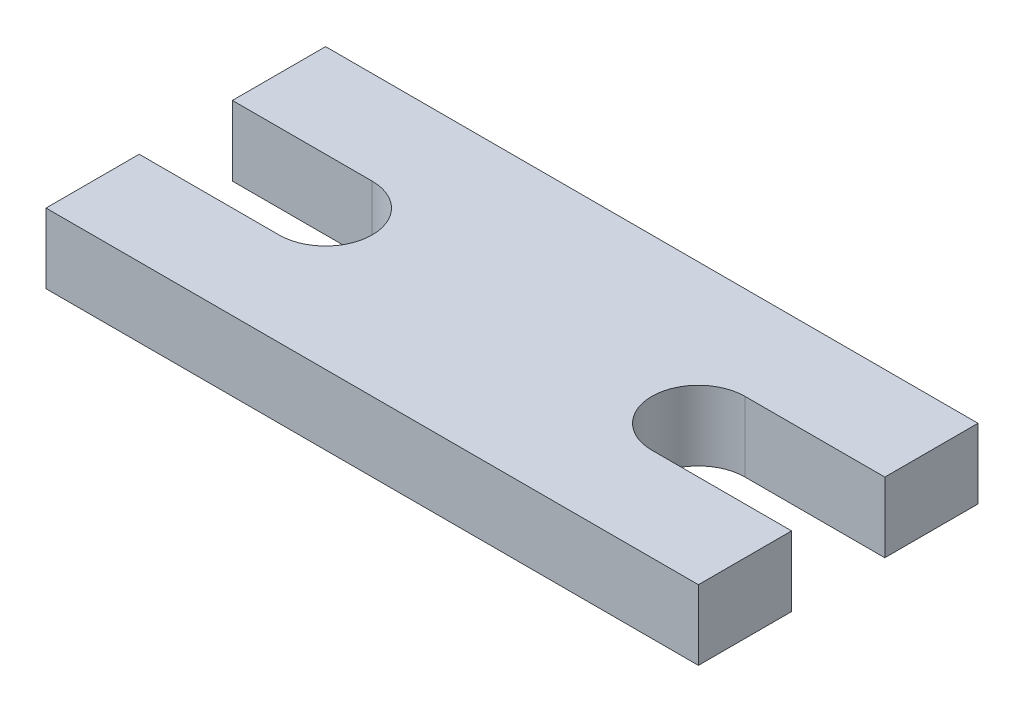
ISO-10303-21;
HEADER;
FILE_DESCRIPTION(('STEP AP214'),'2;1');
FILE_NAME('part.step','',(''),(''),'','','');
FILE_SCHEMA(('AUTOMOTIVE_DESIGN { 1 0 10303 214 1 1 1 1 }'));
ENDSEC;
DATA;
#1=APPLICATION_CONTEXT('core data for automotive mechanical design processes');
#2=APPLICATION_PROTOCOL_DEFINITION('international standard','automotive_design',2000,#1);
#3=PRODUCT_CONTEXT('',#1,'mechanical');
#4=PRODUCT('Part','Part','',(#3));
#5=PRODUCT_RELATED_PRODUCT_CATEGORY('part','',(#4));
#6=PRODUCT_DEFINITION_FORMATION('','',#4);
#7=PRODUCT_DEFINITION_CONTEXT('part definition',#1,'design');
#8=PRODUCT_DEFINITION('design','',#6,#7);
#9=PRODUCT_DEFINITION_SHAPE('','',#8);
#10=(LENGTH_UNIT() NAMED_UNIT(*) SI_UNIT(.MILLI.,.METRE.));
#11=(NAMED_UNIT(*) PLANE_ANGLE_UNIT() SI_UNIT($,.RADIAN.));
#12=(NAMED_UNIT(*) SI_UNIT($,.STERADIAN.) SOLID_ANGLE_UNIT());
#13=UNCERTAINTY_MEASURE_WITH_UNIT(LENGTH_MEASURE(1.E-05),#10,'distance_accuracy_value','');
#14=(GEOMETRIC_REPRESENTATION_CONTEXT(3) GLOBAL_UNCERTAINTY_ASSIGNED_CONTEXT((#13)) GLOBAL_UNIT_ASSIGNED_CONTEXT((#10,
#11,#12)) REPRESENTATION_CONTEXT('',''));
#15=CARTESIAN_POINT('',(0.,0.,0.));
#16=DIRECTION('',(0.,0.,1.));
#17=DIRECTION('',(1.,0.,0.));
#18=AXIS2_PLACEMENT_3D('',#15,#16,#17);
#19=CARTESIAN_POINT('',(22.225,2.38125,0.));
#20=DIRECTION('',(-1.,0.,0.));
#21=DIRECTION('',(0.,0.,1.));
#22=AXIS2_PLACEMENT_3D('',#19,#20,#21);
#23=PLANE('',#22);
#24=DIRECTION('',(0.,0.,-1.));
#25=VECTOR('',#24,1.);
#26=CARTESIAN_POINT('',(22.225,2.38125,0.));
#27=LINE('',#26,#25);
#28=CARTESIAN_POINT('',(22.225,2.38125,-6.35));
#29=VERTEX_POINT('',#28);
#30=CARTESIAN_POINT('',(22.225,2.38125,-9.525));
#31=VERTEX_POINT('',#30);
#32=EDGE_CURVE('E194',#29,#31,#27,.T.);
#33=ORIENTED_EDGE('',*,*,#32,.F.);
#34=DIRECTION('',(0.,1.,0.));
#35=VECTOR('',#34,1.);
#36=CARTESIAN_POINT('',(22.225,0.,-6.35));
#37=LINE('',#36,#35);
#38=CARTESIAN_POINT('',(22.225,0.,-6.35));
#39=VERTEX_POINT('',#38);
#40=EDGE_CURVE('E157',#39,#29,#37,.T.);
#41=ORIENTED_EDGE('',*,*,#40,.F.);
#42=DIRECTION('',(0.,0.,-1.));
#43=VECTOR('',#42,1.);
#44=CARTESIAN_POINT('',(22.225,0.,0.));
#45=LINE('',#44,#43);
#46=CARTESIAN_POINT('',(22.225,0.,-9.525));
#47=VERTEX_POINT('',#46);
#48=EDGE_CURVE('E148',#39,#47,#45,.T.);
#49=ORIENTED_EDGE('',*,*,#48,.T.);
#50=DIRECTION('',(0.,-1.,0.));
#51=VECTOR('',#50,1.);
#52=CARTESIAN_POINT('',(22.225,2.38125,-9.525));
#53=LINE('',#52,#51);
#54=EDGE_CURVE('E213',#31,#47,#53,.T.);
#55=ORIENTED_EDGE('',*,*,#54,.F.);
#56=EDGE_LOOP('',(#33,#41,#49,#55));
#57=FACE_BOUND('',#56,.T.);
#58=ADVANCED_FACE('F39',(#57),#23,.F.);
#59=CARTESIAN_POINT('',(0.,2.38125,0.));
#60=DIRECTION('',(1.,0.,0.));
#61=DIRECTION('',(0.,0.,-1.));
#62=AXIS2_PLACEMENT_3D('',#59,#60,#61);
#63=PLANE('',#62);
#64=DIRECTION('',(0.,0.,1.));
#65=VECTOR('',#64,1.);
#66=CARTESIAN_POINT('',(0.,0.,0.));
#67=LINE('',#66,#65);
#68=CARTESIAN_POINT('',(0.,0.,-9.525));
#69=VERTEX_POINT('',#68);
#70=CARTESIAN_POINT('',(0.,0.,-6.35));
#71=VERTEX_POINT('',#70);
#72=EDGE_CURVE('E201',#69,#71,#67,.T.);
#73=ORIENTED_EDGE('',*,*,#72,.T.);
#74=DIRECTION('',(0.,1.,0.));
#75=VECTOR('',#74,1.);
#76=CARTESIAN_POINT('',(0.,0.,-6.35));
#77=LINE('',#76,#75);
#78=CARTESIAN_POINT('',(0.,2.38125,-6.35));
#79=VERTEX_POINT('',#78);
#80=EDGE_CURVE('E179',#71,#79,#77,.T.);
#81=ORIENTED_EDGE('',*,*,#80,.T.);
#82=DIRECTION('',(0.,0.,1.));
#83=VECTOR('',#82,1.);
#84=CARTESIAN_POINT('',(0.,2.38125,0.));
#85=LINE('',#84,#83);
#86=CARTESIAN_POINT('',(0.,2.38125,-9.525));
#87=VERTEX_POINT('',#86);
#88=EDGE_CURVE('E188',#87,#79,#85,.T.);
#89=ORIENTED_EDGE('',*,*,#88,.F.);
#90=DIRECTION('',(0.,-1.,0.));
#91=VECTOR('',#90,1.);
#92=CARTESIAN_POINT('',(0.,2.38125,-9.525));
#93=LINE('',#92,#91);
#94=EDGE_CURVE('E200',#87,#69,#93,.T.);
#95=ORIENTED_EDGE('',*,*,#94,.T.);
#96=EDGE_LOOP('',(#73,#81,#89,#95));
#97=FACE_BOUND('',#96,.T.);
#98=ADVANCED_FACE('F242',(#97),#63,.F.);
#99=CARTESIAN_POINT('',(0.,2.38125,-3.175));
#100=VERTEX_POINT('',#99);
#101=CARTESIAN_POINT('',(0.,2.38125,0.));
#102=VERTEX_POINT('',#101);
#103=EDGE_CURVE('E192',#100,#102,#85,.T.);
#104=ORIENTED_EDGE('',*,*,#103,.F.);
#105=DIRECTION('',(0.,1.,0.));
#106=VECTOR('',#105,1.);
#107=CARTESIAN_POINT('',(0.,0.,-3.175));
#108=LINE('',#107,#106);
#109=CARTESIAN_POINT('',(0.,0.,-3.175));
#110=VERTEX_POINT('',#109);
#111=EDGE_CURVE('E172',#110,#100,#108,.T.);
#112=ORIENTED_EDGE('',*,*,#111,.F.);
#113=CARTESIAN_POINT('',(0.,0.,0.));
#114=VERTEX_POINT('',#113);
#115=EDGE_CURVE('E182',#110,#114,#67,.T.);
#116=ORIENTED_EDGE('',*,*,#115,.T.);
#117=DIRECTION('',(0.,-1.,0.));
#118=VECTOR('',#117,1.);
#119=CARTESIAN_POINT('',(0.,2.38125,0.));
#120=LINE('',#119,#118);
#121=EDGE_CURVE('E11',#102,#114,#120,.T.);
#122=ORIENTED_EDGE('',*,*,#121,.F.);
#123=EDGE_LOOP('',(#104,#112,#116,#122));
#124=FACE_BOUND('',#123,.T.);
#125=ADVANCED_FACE('F41',(#124),#63,.F.);
#126=CARTESIAN_POINT('',(0.,2.38125,0.));
#127=DIRECTION('',(0.,0.,-1.));
#128=DIRECTION('',(-1.,0.,0.));
#129=AXIS2_PLACEMENT_3D('',#126,#127,#128);
#130=PLANE('',#129);
#131=DIRECTION('',(1.,0.,0.));
#132=VECTOR('',#131,1.);
#133=CARTESIAN_POINT('',(0.,0.,0.));
#134=LINE('',#133,#132);
#135=CARTESIAN_POINT('',(22.225,0.,0.));
#136=VERTEX_POINT('',#135);
#137=EDGE_CURVE('E204',#114,#136,#134,.T.);
#138=ORIENTED_EDGE('',*,*,#137,.T.);
#139=DIRECTION('',(0.,-1.,0.));
#140=VECTOR('',#139,1.);
#141=CARTESIAN_POINT('',(22.225,2.38125,0.));
#142=LINE('',#141,#140);
#143=CARTESIAN_POINT('',(22.225,2.38125,0.));
#144=VERTEX_POINT('',#143);
#145=EDGE_CURVE('E47',#144,#136,#142,.T.);
#146=ORIENTED_EDGE('',*,*,#145,.F.);
#147=DIRECTION('',(1.,0.,0.));
#148=VECTOR('',#147,1.);
#149=CARTESIAN_POINT('',(0.,2.38125,0.));
#150=LINE('',#149,#148);
#151=EDGE_CURVE('E191',#102,#144,#150,.T.);
#152=ORIENTED_EDGE('',*,*,#151,.F.);
#153=ORIENTED_EDGE('',*,*,#121,.T.);
#154=EDGE_LOOP('',(#138,#146,#152,#153));
#155=FACE_BOUND('',#154,.T.);
#156=ADVANCED_FACE('F226',(#155),#130,.F.);
#157=CARTESIAN_POINT('',(22.225,0.,-3.17500000000122));
#158=VERTEX_POINT('',#157);
#159=EDGE_CURVE('E206',#136,#158,#45,.T.);
#160=ORIENTED_EDGE('',*,*,#159,.T.);
#161=DIRECTION('',(0.,1.,0.));
#162=VECTOR('',#161,1.);
#163=CARTESIAN_POINT('',(22.225,0.,-3.17500000000122));
#164=LINE('',#163,#162);
#165=CARTESIAN_POINT('',(22.225,2.38125,-3.17500000000122));
#166=VERTEX_POINT('',#165);
#167=EDGE_CURVE('E160',#158,#166,#164,.T.);
#168=ORIENTED_EDGE('',*,*,#167,.T.);
#169=EDGE_CURVE('E195',#144,#166,#27,.T.);
#170=ORIENTED_EDGE('',*,*,#169,.F.);
#171=ORIENTED_EDGE('',*,*,#145,.T.);
#172=EDGE_LOOP('',(#160,#168,#170,#171));
#173=FACE_BOUND('',#172,.T.);
#174=ADVANCED_FACE('F220',(#173),#23,.F.);
#175=CARTESIAN_POINT('',(0.,2.38125,-9.525));
#176=DIRECTION('',(0.,0.,1.));
#177=DIRECTION('',(1.,0.,0.));
#178=AXIS2_PLACEMENT_3D('',#175,#176,#177);
#179=PLANE('',#178);
#180=DIRECTION('',(-1.,0.,0.));
#181=VECTOR('',#180,1.);
#182=CARTESIAN_POINT('',(0.,0.,-9.525));
#183=LINE('',#182,#181);
#184=EDGE_CURVE('E209',#47,#69,#183,.T.);
#185=ORIENTED_EDGE('',*,*,#184,.T.);
#186=ORIENTED_EDGE('',*,*,#94,.F.);
#187=DIRECTION('',(-1.,0.,0.));
#188=VECTOR('',#187,1.);
#189=CARTESIAN_POINT('',(0.,2.38125,-9.525));
#190=LINE('',#189,#188);
#191=EDGE_CURVE('E198',#31,#87,#190,.T.);
#192=ORIENTED_EDGE('',*,*,#191,.F.);
#193=ORIENTED_EDGE('',*,*,#54,.T.);
#194=EDGE_LOOP('',(#185,#186,#192,#193));
#195=FACE_BOUND('',#194,.T.);
#196=ADVANCED_FACE('F247',(#195),#179,.F.);
#197=CARTESIAN_POINT('',(0.,2.38125,-9.525));
#198=DIRECTION('',(0.,-1.,0.));
#199=DIRECTION('',(0.,0.,-1.));
#200=AXIS2_PLACEMENT_3D('',#197,#198,#199);
#201=PLANE('',#200);
#202=CARTESIAN_POINT('',(17.4625,2.38125,-4.7625));
#203=DIRECTION('',(0.,1.,0.));
#204=DIRECTION('',(0.,0.,-1.));
#205=AXIS2_PLACEMENT_3D('',#202,#203,#204);
#206=CIRCLE('',#205,1.58749999999939);
#207=CARTESIAN_POINT('',(17.4625,2.38125,-6.34999999999939));
#208=VERTEX_POINT('',#207);
#209=CARTESIAN_POINT('',(17.4625,2.38125,-3.17500000000122));
#210=VERTEX_POINT('',#209);
#211=EDGE_CURVE('E151',#208,#210,#206,.T.);
#212=ORIENTED_EDGE('',*,*,#211,.F.);
#213=DIRECTION('',(-1.,0.,0.));
#214=VECTOR('',#213,1.);
#215=CARTESIAN_POINT('',(17.4625,2.38125,-6.35));
#216=LINE('',#215,#214);
#217=EDGE_CURVE('E134',#29,#208,#216,.T.);
#218=ORIENTED_EDGE('',*,*,#217,.F.);
#219=ORIENTED_EDGE('',*,*,#32,.T.);
#220=ORIENTED_EDGE('',*,*,#191,.T.);
#221=ORIENTED_EDGE('',*,*,#88,.T.);
#222=DIRECTION('',(-1.,0.,0.));
#223=VECTOR('',#222,1.);
#224=CARTESIAN_POINT('',(0.,2.38125,-6.35));
#225=LINE('',#224,#223);
#226=CARTESIAN_POINT('',(4.7625,2.38125,-6.35));
#227=VERTEX_POINT('',#226);
#228=EDGE_CURVE('E167',#227,#79,#225,.T.);
#229=ORIENTED_EDGE('',*,*,#228,.F.);
#230=CARTESIAN_POINT('',(4.7625,2.38125,-4.7625));
#231=DIRECTION('',(0.,1.,0.));
#232=DIRECTION('',(0.,0.,-1.));
#233=AXIS2_PLACEMENT_3D('',#230,#231,#232);
#234=CIRCLE('',#233,1.5875);
#235=CARTESIAN_POINT('',(4.7625,2.38125,-3.175));
#236=VERTEX_POINT('',#235);
#237=EDGE_CURVE('E175',#236,#227,#234,.T.);
#238=ORIENTED_EDGE('',*,*,#237,.F.);
#239=DIRECTION('',(1.,0.,0.));
#240=VECTOR('',#239,1.);
#241=CARTESIAN_POINT('',(0.,2.38125,-3.175));
#242=LINE('',#241,#240);
#243=EDGE_CURVE('E159',#100,#236,#242,.T.);
#244=ORIENTED_EDGE('',*,*,#243,.F.);
#245=ORIENTED_EDGE('',*,*,#103,.T.);
#246=ORIENTED_EDGE('',*,*,#151,.T.);
#247=ORIENTED_EDGE('',*,*,#169,.T.);
#248=DIRECTION('',(1.,0.,0.));
#249=VECTOR('',#248,1.);
#250=CARTESIAN_POINT('',(17.4625,2.38125,-3.17500000000122));
#251=LINE('',#250,#249);
#252=EDGE_CURVE('E149',#210,#166,#251,.T.);
#253=ORIENTED_EDGE('',*,*,#252,.F.);
#254=EDGE_LOOP('',(#212,#218,#219,#220,#221,#229,#238,#244,#245,#246,#247,#253));
#255=FACE_BOUND('',#254,.T.);
#256=ADVANCED_FACE('F235',(#255),#201,.F.);
#257=CARTESIAN_POINT('',(0.,0.,-9.525));
#258=DIRECTION('',(0.,-1.,0.));
#259=DIRECTION('',(0.,0.,-1.));
#260=AXIS2_PLACEMENT_3D('',#257,#258,#259);
#261=PLANE('',#260);
#262=DIRECTION('',(-1.,0.,0.));
#263=VECTOR('',#262,1.);
#264=CARTESIAN_POINT('',(17.4625,0.,-6.35));
#265=LINE('',#264,#263);
#266=CARTESIAN_POINT('',(17.4625,0.,-6.34999999999939));
#267=VERTEX_POINT('',#266);
#268=EDGE_CURVE('E131',#39,#267,#265,.T.);
#269=ORIENTED_EDGE('',*,*,#268,.T.);
#270=CARTESIAN_POINT('',(17.4625,0.,-4.7625));
#271=DIRECTION('',(0.,1.,0.));
#272=DIRECTION('',(0.,0.,-1.));
#273=AXIS2_PLACEMENT_3D('',#270,#271,#272);
#274=CIRCLE('',#273,1.58749999999939);
#275=CARTESIAN_POINT('',(17.4625,0.,-3.17500000000061));
#276=VERTEX_POINT('',#275);
#277=EDGE_CURVE('E141',#267,#276,#274,.T.);
#278=ORIENTED_EDGE('',*,*,#277,.T.);
#279=DIRECTION('',(1.,0.,0.));
#280=VECTOR('',#279,1.);
#281=CARTESIAN_POINT('',(17.4625,0.,-3.17500000000122));
#282=LINE('',#281,#280);
#283=EDGE_CURVE('E54',#276,#158,#282,.T.);
#284=ORIENTED_EDGE('',*,*,#283,.T.);
#285=ORIENTED_EDGE('',*,*,#159,.F.);
#286=ORIENTED_EDGE('',*,*,#137,.F.);
#287=ORIENTED_EDGE('',*,*,#115,.F.);
#288=DIRECTION('',(1.,0.,0.));
#289=VECTOR('',#288,1.);
#290=CARTESIAN_POINT('',(0.,0.,-3.175));
#291=LINE('',#290,#289);
#292=CARTESIAN_POINT('',(4.7625,0.,-3.175));
#293=VERTEX_POINT('',#292);
#294=EDGE_CURVE('E164',#110,#293,#291,.T.);
#295=ORIENTED_EDGE('',*,*,#294,.T.);
#296=CARTESIAN_POINT('',(4.7625,0.,-4.7625));
#297=DIRECTION('',(0.,1.,0.));
#298=DIRECTION('',(0.,0.,-1.));
#299=AXIS2_PLACEMENT_3D('',#296,#297,#298);
#300=CIRCLE('',#299,1.5875);
#301=CARTESIAN_POINT('',(4.7625,0.,-6.35));
#302=VERTEX_POINT('',#301);
#303=EDGE_CURVE('E62',#293,#302,#300,.T.);
#304=ORIENTED_EDGE('',*,*,#303,.T.);
#305=DIRECTION('',(-1.,0.,0.));
#306=VECTOR('',#305,1.);
#307=CARTESIAN_POINT('',(0.,0.,-6.35));
#308=LINE('',#307,#306);
#309=EDGE_CURVE('E169',#302,#71,#308,.T.);
#310=ORIENTED_EDGE('',*,*,#309,.T.);
#311=ORIENTED_EDGE('',*,*,#72,.F.);
#312=ORIENTED_EDGE('',*,*,#184,.F.);
#313=ORIENTED_EDGE('',*,*,#48,.F.);
#314=EDGE_LOOP('',(#269,#278,#284,#285,#286,#287,#295,#304,#310,#311,#312,#313));
#315=FACE_BOUND('',#314,.T.);
#316=ADVANCED_FACE('F146',(#315),#261,.T.);
#317=CARTESIAN_POINT('',(0.,0.,-6.35));
#318=DIRECTION('',(0.,0.,-1.));
#319=DIRECTION('',(-1.,0.,0.));
#320=AXIS2_PLACEMENT_3D('',#317,#318,#319);
#321=PLANE('',#320);
#322=ORIENTED_EDGE('',*,*,#228,.T.);
#323=ORIENTED_EDGE('',*,*,#80,.F.);
#324=ORIENTED_EDGE('',*,*,#309,.F.);
#325=DIRECTION('',(0.,1.,0.));
#326=VECTOR('',#325,1.);
#327=CARTESIAN_POINT('',(4.7625,0.,-6.35));
#328=LINE('',#327,#326);
#329=EDGE_CURVE('E183',#302,#227,#328,.T.);
#330=ORIENTED_EDGE('',*,*,#329,.T.);
#331=EDGE_LOOP('',(#322,#323,#324,#330));
#332=FACE_BOUND('',#331,.T.);
#333=ADVANCED_FACE('F292',(#332),#321,.F.);
#334=CARTESIAN_POINT('',(4.7625,0.,-4.7625));
#335=DIRECTION('',(0.,1.,0.));
#336=DIRECTION('',(0.,0.,1.));
#337=AXIS2_PLACEMENT_3D('',#334,#335,#336);
#338=CYLINDRICAL_SURFACE('',#337,1.5875);
#339=ORIENTED_EDGE('',*,*,#237,.T.);
#340=ORIENTED_EDGE('',*,*,#329,.F.);
#341=ORIENTED_EDGE('',*,*,#303,.F.);
#342=DIRECTION('',(0.,1.,0.));
#343=VECTOR('',#342,1.);
#344=CARTESIAN_POINT('',(4.7625,0.,-3.175));
#345=LINE('',#344,#343);
#346=EDGE_CURVE('E185',#293,#236,#345,.T.);
#347=ORIENTED_EDGE('',*,*,#346,.T.);
#348=EDGE_LOOP('',(#339,#340,#341,#347));
#349=FACE_BOUND('',#348,.T.);
#350=ADVANCED_FACE('F237',(#349),#338,.F.);
#351=CARTESIAN_POINT('',(0.,0.,-3.175));
#352=DIRECTION('',(0.,0.,1.));
#353=DIRECTION('',(1.,0.,0.));
#354=AXIS2_PLACEMENT_3D('',#351,#352,#353);
#355=PLANE('',#354);
#356=ORIENTED_EDGE('',*,*,#243,.T.);
#357=ORIENTED_EDGE('',*,*,#346,.F.);
#358=ORIENTED_EDGE('',*,*,#294,.F.);
#359=ORIENTED_EDGE('',*,*,#111,.T.);
#360=EDGE_LOOP('',(#356,#357,#358,#359));
#361=FACE_BOUND('',#360,.T.);
#362=ADVANCED_FACE('F232',(#361),#355,.F.);
#363=CARTESIAN_POINT('',(17.4625,0.,-6.35));
#364=DIRECTION('',(0.,0.,-1.));
#365=DIRECTION('',(-1.,0.,0.));
#366=AXIS2_PLACEMENT_3D('',#363,#364,#365);
#367=PLANE('',#366);
#368=ORIENTED_EDGE('',*,*,#217,.T.);
#369=DIRECTION('',(0.,1.,0.));
#370=VECTOR('',#369,1.);
#371=CARTESIAN_POINT('',(17.4625,0.,-6.34999999999939));
#372=LINE('',#371,#370);
#373=EDGE_CURVE('E127',#267,#208,#372,.T.);
#374=ORIENTED_EDGE('',*,*,#373,.F.);
#375=ORIENTED_EDGE('',*,*,#268,.F.);
#376=ORIENTED_EDGE('',*,*,#40,.T.);
#377=EDGE_LOOP('',(#368,#374,#375,#376));
#378=FACE_BOUND('',#377,.T.);
#379=ADVANCED_FACE('F129',(#378),#367,.F.);
#380=CARTESIAN_POINT('',(17.4625,0.,-3.17500000000122));
#381=DIRECTION('',(0.,0.,1.));
#382=DIRECTION('',(1.,0.,0.));
#383=AXIS2_PLACEMENT_3D('',#380,#381,#382);
#384=PLANE('',#383);
#385=ORIENTED_EDGE('',*,*,#252,.T.);
#386=ORIENTED_EDGE('',*,*,#167,.F.);
#387=ORIENTED_EDGE('',*,*,#283,.F.);
#388=DIRECTION('',(0.,1.,0.));
#389=VECTOR('',#388,1.);
#390=CARTESIAN_POINT('',(17.4625,0.,-3.17500000000122));
#391=LINE('',#390,#389);
#392=EDGE_CURVE('E138',#276,#210,#391,.T.);
#393=ORIENTED_EDGE('',*,*,#392,.T.);
#394=EDGE_LOOP('',(#385,#386,#387,#393));
#395=FACE_BOUND('',#394,.T.);
#396=ADVANCED_FACE('F252',(#395),#384,.F.);
#397=CARTESIAN_POINT('',(17.4625,0.,-4.7625));
#398=DIRECTION('',(0.,1.,0.));
#399=DIRECTION('',(0.,0.,1.));
#400=AXIS2_PLACEMENT_3D('',#397,#398,#399);
#401=CYLINDRICAL_SURFACE('',#400,1.58749999999939);
#402=ORIENTED_EDGE('',*,*,#211,.T.);
#403=ORIENTED_EDGE('',*,*,#392,.F.);
#404=ORIENTED_EDGE('',*,*,#277,.F.);
#405=ORIENTED_EDGE('',*,*,#373,.T.);
#406=EDGE_LOOP('',(#402,#403,#404,#405));
#407=FACE_BOUND('',#406,.T.);
#408=ADVANCED_FACE('F142',(#407),#401,.F.);
#409=CLOSED_SHELL('',(#58,#98,#125,#156,#174,#196,#256,#316,#333,#350,#362,#379,#396,#408));
#410=MANIFOLD_SOLID_BREP('B2',#409);
#411=ADVANCED_BREP_SHAPE_REPRESENTATION('',(#18,#410),#14);
#412=SHAPE_DEFINITION_REPRESENTATION(#9,#411);
ENDSEC;
END-ISO-10303-21;
